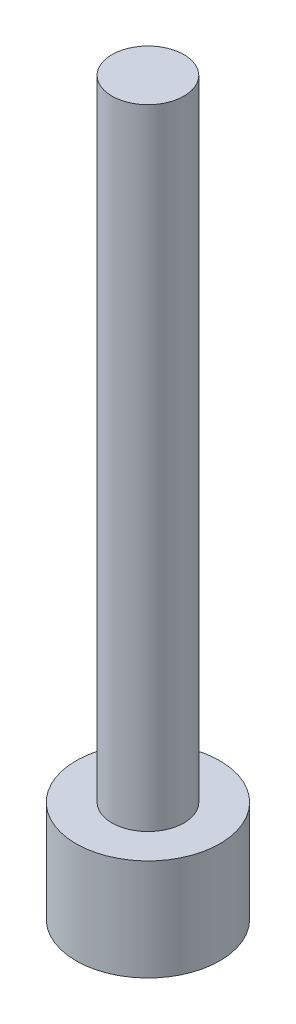
ISO-10303-21;
HEADER;
FILE_DESCRIPTION(('STEP AP214'),'2;1');
FILE_NAME('part.step','',(''),(''),'','','');
FILE_SCHEMA(('AUTOMOTIVE_DESIGN { 1 0 10303 214 1 1 1 1 }'));
ENDSEC;
DATA;
#1=APPLICATION_CONTEXT('core data for automotive mechanical design processes');
#2=APPLICATION_PROTOCOL_DEFINITION('international standard','automotive_design',2000,#1);
#3=PRODUCT_CONTEXT('',#1,'mechanical');
#4=PRODUCT('Part','Part','',(#3));
#5=PRODUCT_RELATED_PRODUCT_CATEGORY('part','',(#4));
#6=PRODUCT_DEFINITION_FORMATION('','',#4);
#7=PRODUCT_DEFINITION_CONTEXT('part definition',#1,'design');
#8=PRODUCT_DEFINITION('design','',#6,#7);
#9=PRODUCT_DEFINITION_SHAPE('','',#8);
#10=(LENGTH_UNIT() NAMED_UNIT(*) SI_UNIT(.MILLI.,.METRE.));
#11=(NAMED_UNIT(*) PLANE_ANGLE_UNIT() SI_UNIT($,.RADIAN.));
#12=(NAMED_UNIT(*) SI_UNIT($,.STERADIAN.) SOLID_ANGLE_UNIT());
#13=UNCERTAINTY_MEASURE_WITH_UNIT(LENGTH_MEASURE(1.E-05),#10,'distance_accuracy_value','');
#14=(GEOMETRIC_REPRESENTATION_CONTEXT(3) GLOBAL_UNCERTAINTY_ASSIGNED_CONTEXT((#13)) GLOBAL_UNIT_ASSIGNED_CONTEXT((#10,
#11,#12)) REPRESENTATION_CONTEXT('',''));
#15=CARTESIAN_POINT('',(0.,0.,0.));
#16=DIRECTION('',(0.,0.,1.));
#17=DIRECTION('',(1.,0.,0.));
#18=AXIS2_PLACEMENT_3D('',#15,#16,#17);
#19=CARTESIAN_POINT('',(0.,0.,0.));
#20=DIRECTION('',(0.,1.,0.));
#21=DIRECTION('',(0.,0.,1.));
#22=AXIS2_PLACEMENT_3D('',#19,#20,#21);
#23=PLANE('',#22);
#24=CARTESIAN_POINT('',(0.,0.,0.));
#25=DIRECTION('',(0.,1.,0.));
#26=DIRECTION('',(0.,0.,1.));
#27=AXIS2_PLACEMENT_3D('',#24,#25,#26);
#28=CIRCLE('',#27,8.00000000000001);
#29=CARTESIAN_POINT('',(0.,0.,8.00000000000001));
#30=VERTEX_POINT('',#29);
#31=EDGE_CURVE('E10',#30,#30,#28,.T.);
#32=ORIENTED_EDGE('',*,*,#31,.F.);
#33=EDGE_LOOP('',(#32));
#34=FACE_BOUND('',#33,.T.);
#35=ADVANCED_FACE('F32',(#34),#23,.F.);
#36=CARTESIAN_POINT('',(0.,101.789289686954,0.));
#37=DIRECTION('',(0.,1.,0.));
#38=DIRECTION('',(0.,0.,1.));
#39=AXIS2_PLACEMENT_3D('',#36,#37,#38);
#40=CYLINDRICAL_SURFACE('',#39,8.00000000000001);
#41=CARTESIAN_POINT('',(0.,11.2811059907834,0.));
#42=DIRECTION('',(0.,1.,0.));
#43=DIRECTION('',(0.,0.,1.));
#44=AXIS2_PLACEMENT_3D('',#41,#42,#43);
#45=CIRCLE('',#44,8.00000000000001);
#46=CARTESIAN_POINT('',(0.,11.2811059907834,8.00000000000001));
#47=VERTEX_POINT('',#46);
#48=EDGE_CURVE('E38',#47,#47,#45,.T.);
#49=ORIENTED_EDGE('',*,*,#48,.F.);
#50=EDGE_LOOP('',(#49));
#51=FACE_BOUND('',#50,.T.);
#52=ORIENTED_EDGE('',*,*,#31,.T.);
#53=EDGE_LOOP('',(#52));
#54=FACE_BOUND('',#53,.T.);
#55=ADVANCED_FACE('F62',(#51,#54),#40,.T.);
#56=CARTESIAN_POINT('',(0.,11.2811059907834,-8.00000000000001));
#57=DIRECTION('',(0.,-1.,0.));
#58=DIRECTION('',(0.,0.,-1.));
#59=AXIS2_PLACEMENT_3D('',#56,#57,#58);
#60=PLANE('',#59);
#61=CARTESIAN_POINT('',(0.,11.2811059907834,0.));
#62=DIRECTION('',(0.,1.,0.));
#63=DIRECTION('',(0.,0.,1.));
#64=AXIS2_PLACEMENT_3D('',#61,#62,#63);
#65=CIRCLE('',#64,4.);
#66=CARTESIAN_POINT('',(0.,11.2811059907834,4.));
#67=VERTEX_POINT('',#66);
#68=EDGE_CURVE('E42',#67,#67,#65,.T.);
#69=ORIENTED_EDGE('',*,*,#68,.F.);
#70=EDGE_LOOP('',(#69));
#71=FACE_BOUND('',#70,.T.);
#72=ORIENTED_EDGE('',*,*,#48,.T.);
#73=EDGE_LOOP('',(#72));
#74=FACE_BOUND('',#73,.T.);
#75=ADVANCED_FACE('F57',(#71,#74),#60,.F.);
#76=CARTESIAN_POINT('',(0.,101.789289686954,0.));
#77=DIRECTION('',(0.,1.,0.));
#78=DIRECTION('',(0.,0.,1.));
#79=AXIS2_PLACEMENT_3D('',#76,#77,#78);
#80=CYLINDRICAL_SURFACE('',#79,4.);
#81=CARTESIAN_POINT('',(0.,81.3017638646115,0.));
#82=DIRECTION('',(0.,1.,0.));
#83=DIRECTION('',(0.,0.,1.));
#84=AXIS2_PLACEMENT_3D('',#81,#82,#83);
#85=CIRCLE('',#84,4.);
#86=CARTESIAN_POINT('',(0.,81.3017638646115,4.));
#87=VERTEX_POINT('',#86);
#88=EDGE_CURVE('E46',#87,#87,#85,.T.);
#89=ORIENTED_EDGE('',*,*,#88,.F.);
#90=EDGE_LOOP('',(#89));
#91=FACE_BOUND('',#90,.T.);
#92=ORIENTED_EDGE('',*,*,#68,.T.);
#93=EDGE_LOOP('',(#92));
#94=FACE_BOUND('',#93,.T.);
#95=ADVANCED_FACE('F54',(#91,#94),#80,.T.);
#96=CARTESIAN_POINT('',(0.,81.3017638646115,-4.));
#97=DIRECTION('',(0.,-1.,0.));
#98=DIRECTION('',(0.,0.,-1.));
#99=AXIS2_PLACEMENT_3D('',#96,#97,#98);
#100=PLANE('',#99);
#101=ORIENTED_EDGE('',*,*,#88,.T.);
#102=EDGE_LOOP('',(#101));
#103=FACE_BOUND('',#102,.T.);
#104=ADVANCED_FACE('F52',(#103),#100,.F.);
#105=CLOSED_SHELL('',(#35,#55,#75,#95,#104));
#106=MANIFOLD_SOLID_BREP('B2',#105);
#107=ADVANCED_BREP_SHAPE_REPRESENTATION('',(#18,#106),#14);
#108=SHAPE_DEFINITION_REPRESENTATION(#9,#107);
ENDSEC;
END-ISO-10303-21;
